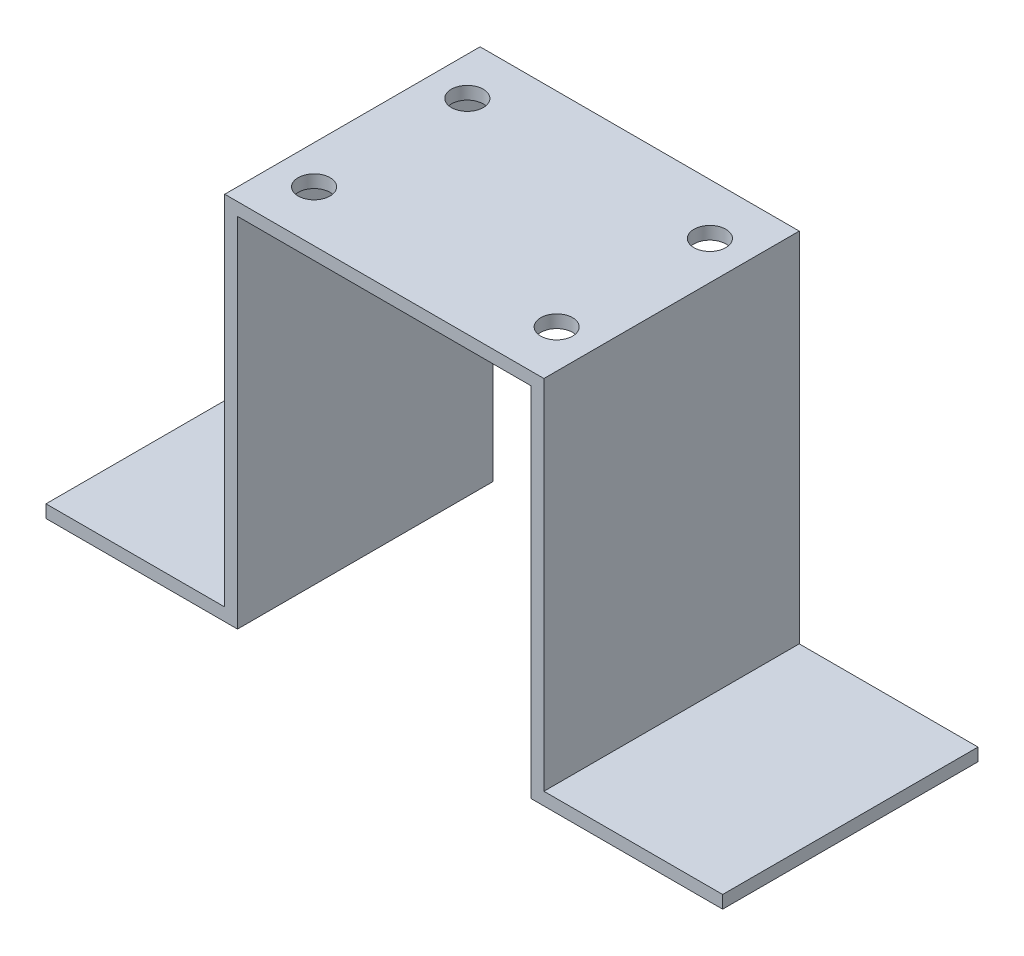
ISO-10303-21;
HEADER;
FILE_DESCRIPTION(('STEP AP214'),'2;1');
FILE_NAME('part.step','',(''),(''),'','','');
FILE_SCHEMA(('AUTOMOTIVE_DESIGN { 1 0 10303 214 1 1 1 1 }'));
ENDSEC;
DATA;
#1=APPLICATION_CONTEXT('core data for automotive mechanical design processes');
#2=APPLICATION_PROTOCOL_DEFINITION('international standard','automotive_design',2000,#1);
#3=PRODUCT_CONTEXT('',#1,'mechanical');
#4=PRODUCT('Part','Part','',(#3));
#5=PRODUCT_RELATED_PRODUCT_CATEGORY('part','',(#4));
#6=PRODUCT_DEFINITION_FORMATION('','',#4);
#7=PRODUCT_DEFINITION_CONTEXT('part definition',#1,'design');
#8=PRODUCT_DEFINITION('design','',#6,#7);
#9=PRODUCT_DEFINITION_SHAPE('','',#8);
#10=(LENGTH_UNIT() NAMED_UNIT(*) SI_UNIT(.MILLI.,.METRE.));
#11=(NAMED_UNIT(*) PLANE_ANGLE_UNIT() SI_UNIT($,.RADIAN.));
#12=(NAMED_UNIT(*) SI_UNIT($,.STERADIAN.) SOLID_ANGLE_UNIT());
#13=UNCERTAINTY_MEASURE_WITH_UNIT(LENGTH_MEASURE(1.E-05),#10,'distance_accuracy_value','');
#14=(GEOMETRIC_REPRESENTATION_CONTEXT(3) GLOBAL_UNCERTAINTY_ASSIGNED_CONTEXT((#13)) GLOBAL_UNIT_ASSIGNED_CONTEXT((#10,
#11,#12)) REPRESENTATION_CONTEXT('',''));
#15=CARTESIAN_POINT('',(0.,0.,0.));
#16=DIRECTION('',(0.,0.,1.));
#17=DIRECTION('',(1.,0.,0.));
#18=AXIS2_PLACEMENT_3D('',#15,#16,#17);
#19=CARTESIAN_POINT('',(0.,2.54,-50.8));
#20=DIRECTION('',(-1.,0.,0.));
#21=DIRECTION('',(0.,0.,1.));
#22=AXIS2_PLACEMENT_3D('',#19,#20,#21);
#23=PLANE('',#22);
#24=DIRECTION('',(0.,-1.,0.));
#25=VECTOR('',#24,1.);
#26=CARTESIAN_POINT('',(0.,2.54,0.));
#27=LINE('',#26,#25);
#28=CARTESIAN_POINT('',(0.,2.54,0.));
#29=VERTEX_POINT('',#28);
#30=CARTESIAN_POINT('',(0.,0.,0.));
#31=VERTEX_POINT('',#30);
#32=EDGE_CURVE('E154',#29,#31,#27,.T.);
#33=ORIENTED_EDGE('',*,*,#32,.F.);
#34=DIRECTION('',(0.,0.,1.));
#35=VECTOR('',#34,1.);
#36=CARTESIAN_POINT('',(0.,2.54,-50.8));
#37=LINE('',#36,#35);
#38=CARTESIAN_POINT('',(0.,2.54,-50.8));
#39=VERTEX_POINT('',#38);
#40=EDGE_CURVE('E11',#39,#29,#37,.T.);
#41=ORIENTED_EDGE('',*,*,#40,.F.);
#42=DIRECTION('',(0.,-1.,0.));
#43=VECTOR('',#42,1.);
#44=CARTESIAN_POINT('',(0.,2.54,-50.8));
#45=LINE('',#44,#43);
#46=CARTESIAN_POINT('',(0.,0.,-50.8));
#47=VERTEX_POINT('',#46);
#48=EDGE_CURVE('E187',#39,#47,#45,.T.);
#49=ORIENTED_EDGE('',*,*,#48,.T.);
#50=DIRECTION('',(0.,0.,1.));
#51=VECTOR('',#50,1.);
#52=CARTESIAN_POINT('',(0.,0.,-50.8));
#53=LINE('',#52,#51);
#54=EDGE_CURVE('E36',#47,#31,#53,.T.);
#55=ORIENTED_EDGE('',*,*,#54,.T.);
#56=EDGE_LOOP('',(#33,#41,#49,#55));
#57=FACE_BOUND('',#56,.T.);
#58=ADVANCED_FACE('F33',(#57),#23,.T.);
#59=CARTESIAN_POINT('',(35.56,2.54,-50.8));
#60=DIRECTION('',(0.,1.,0.));
#61=DIRECTION('',(0.,0.,1.));
#62=AXIS2_PLACEMENT_3D('',#59,#60,#61);
#63=PLANE('',#62);
#64=DIRECTION('',(-1.,0.,0.));
#65=VECTOR('',#64,1.);
#66=CARTESIAN_POINT('',(35.56,2.54,0.));
#67=LINE('',#66,#65);
#68=CARTESIAN_POINT('',(35.56,2.54,0.));
#69=VERTEX_POINT('',#68);
#70=EDGE_CURVE('E185',#69,#29,#67,.T.);
#71=ORIENTED_EDGE('',*,*,#70,.F.);
#72=DIRECTION('',(0.,0.,1.));
#73=VECTOR('',#72,1.);
#74=CARTESIAN_POINT('',(35.56,2.54,-50.8));
#75=LINE('',#74,#73);
#76=CARTESIAN_POINT('',(35.56,2.54,-50.8));
#77=VERTEX_POINT('',#76);
#78=EDGE_CURVE('E42',#77,#69,#75,.T.);
#79=ORIENTED_EDGE('',*,*,#78,.F.);
#80=DIRECTION('',(-1.,0.,0.));
#81=VECTOR('',#80,1.);
#82=CARTESIAN_POINT('',(35.56,2.54,-50.8));
#83=LINE('',#82,#81);
#84=EDGE_CURVE('E144',#77,#39,#83,.T.);
#85=ORIENTED_EDGE('',*,*,#84,.T.);
#86=ORIENTED_EDGE('',*,*,#40,.T.);
#87=EDGE_LOOP('',(#71,#79,#85,#86));
#88=FACE_BOUND('',#87,.T.);
#89=ADVANCED_FACE('F207',(#88),#63,.T.);
#90=CARTESIAN_POINT('',(35.56,73.66,-50.8));
#91=DIRECTION('',(-1.,0.,0.));
#92=DIRECTION('',(0.,-1.,0.));
#93=AXIS2_PLACEMENT_3D('',#90,#91,#92);
#94=PLANE('',#93);
#95=DIRECTION('',(0.,-1.,0.));
#96=VECTOR('',#95,1.);
#97=CARTESIAN_POINT('',(35.56,73.66,0.));
#98=LINE('',#97,#96);
#99=CARTESIAN_POINT('',(35.56,73.66,0.));
#100=VERTEX_POINT('',#99);
#101=EDGE_CURVE('E131',#100,#69,#98,.T.);
#102=ORIENTED_EDGE('',*,*,#101,.F.);
#103=DIRECTION('',(0.,0.,1.));
#104=VECTOR('',#103,1.);
#105=CARTESIAN_POINT('',(35.56,73.66,-50.8));
#106=LINE('',#105,#104);
#107=CARTESIAN_POINT('',(35.56,73.66,-50.8));
#108=VERTEX_POINT('',#107);
#109=EDGE_CURVE('E126',#108,#100,#106,.T.);
#110=ORIENTED_EDGE('',*,*,#109,.F.);
#111=DIRECTION('',(0.,-1.,0.));
#112=VECTOR('',#111,1.);
#113=CARTESIAN_POINT('',(35.56,73.66,-50.8));
#114=LINE('',#113,#112);
#115=EDGE_CURVE('E129',#108,#77,#114,.T.);
#116=ORIENTED_EDGE('',*,*,#115,.T.);
#117=ORIENTED_EDGE('',*,*,#78,.T.);
#118=EDGE_LOOP('',(#102,#110,#116,#117));
#119=FACE_BOUND('',#118,.T.);
#120=ADVANCED_FACE('F128',(#119),#94,.T.);
#121=CARTESIAN_POINT('',(99.06,73.66,-50.8));
#122=DIRECTION('',(0.,1.,0.));
#123=DIRECTION('',(-1.,0.,0.));
#124=AXIS2_PLACEMENT_3D('',#121,#122,#123);
#125=PLANE('',#124);
#126=CARTESIAN_POINT('',(43.18,73.66,-40.64));
#127=DIRECTION('',(0.,1.,0.));
#128=DIRECTION('',(-1.,0.,0.));
#129=AXIS2_PLACEMENT_3D('',#126,#127,#128);
#130=CIRCLE('',#129,3.17500000000001);
#131=CARTESIAN_POINT('',(40.005,73.66,-40.64));
#132=VERTEX_POINT('',#131);
#133=EDGE_CURVE('E279',#132,#132,#130,.T.);
#134=ORIENTED_EDGE('',*,*,#133,.F.);
#135=EDGE_LOOP('',(#134));
#136=FACE_BOUND('',#135,.T.);
#137=CARTESIAN_POINT('',(91.44,73.66,-40.64));
#138=DIRECTION('',(0.,1.,0.));
#139=DIRECTION('',(-1.,0.,0.));
#140=AXIS2_PLACEMENT_3D('',#137,#138,#139);
#141=CIRCLE('',#140,3.175);
#142=CARTESIAN_POINT('',(88.265,73.66,-40.64));
#143=VERTEX_POINT('',#142);
#144=EDGE_CURVE('E283',#143,#143,#141,.T.);
#145=ORIENTED_EDGE('',*,*,#144,.F.);
#146=EDGE_LOOP('',(#145));
#147=FACE_BOUND('',#146,.T.);
#148=CARTESIAN_POINT('',(91.44,73.66,-10.16));
#149=DIRECTION('',(0.,1.,0.));
#150=DIRECTION('',(-1.,0.,0.));
#151=AXIS2_PLACEMENT_3D('',#148,#149,#150);
#152=CIRCLE('',#151,3.175);
#153=CARTESIAN_POINT('',(88.265,73.66,-10.16));
#154=VERTEX_POINT('',#153);
#155=EDGE_CURVE('E290',#154,#154,#152,.T.);
#156=ORIENTED_EDGE('',*,*,#155,.F.);
#157=EDGE_LOOP('',(#156));
#158=FACE_BOUND('',#157,.T.);
#159=CARTESIAN_POINT('',(43.18,73.66,-10.16));
#160=DIRECTION('',(0.,1.,0.));
#161=DIRECTION('',(-1.,0.,0.));
#162=AXIS2_PLACEMENT_3D('',#159,#160,#161);
#163=CIRCLE('',#162,3.17500000000001);
#164=CARTESIAN_POINT('',(40.005,73.66,-10.16));
#165=VERTEX_POINT('',#164);
#166=EDGE_CURVE('E158',#165,#165,#163,.T.);
#167=ORIENTED_EDGE('',*,*,#166,.F.);
#168=EDGE_LOOP('',(#167));
#169=FACE_BOUND('',#168,.T.);
#170=DIRECTION('',(-1.,0.,0.));
#171=VECTOR('',#170,1.);
#172=CARTESIAN_POINT('',(99.06,73.66,0.));
#173=LINE('',#172,#171);
#174=CARTESIAN_POINT('',(99.06,73.66,0.));
#175=VERTEX_POINT('',#174);
#176=EDGE_CURVE('E182',#175,#100,#173,.T.);
#177=ORIENTED_EDGE('',*,*,#176,.F.);
#178=DIRECTION('',(0.,0.,1.));
#179=VECTOR('',#178,1.);
#180=CARTESIAN_POINT('',(99.06,73.66,-50.8));
#181=LINE('',#180,#179);
#182=CARTESIAN_POINT('',(99.06,73.66,-50.8));
#183=VERTEX_POINT('',#182);
#184=EDGE_CURVE('E136',#183,#175,#181,.T.);
#185=ORIENTED_EDGE('',*,*,#184,.F.);
#186=DIRECTION('',(-1.,0.,0.));
#187=VECTOR('',#186,1.);
#188=CARTESIAN_POINT('',(99.06,73.66,-50.8));
#189=LINE('',#188,#187);
#190=EDGE_CURVE('E142',#183,#108,#189,.T.);
#191=ORIENTED_EDGE('',*,*,#190,.T.);
#192=ORIENTED_EDGE('',*,*,#109,.T.);
#193=EDGE_LOOP('',(#177,#185,#191,#192));
#194=FACE_BOUND('',#193,.T.);
#195=ADVANCED_FACE('F146',(#136,#147,#158,#169,#194),#125,.T.);
#196=CARTESIAN_POINT('',(99.06,2.54000000000001,-50.8));
#197=DIRECTION('',(1.,0.,0.));
#198=DIRECTION('',(0.,0.,-1.));
#199=AXIS2_PLACEMENT_3D('',#196,#197,#198);
#200=PLANE('',#199);
#201=DIRECTION('',(0.,1.,0.));
#202=VECTOR('',#201,1.);
#203=CARTESIAN_POINT('',(99.06,2.54000000000001,0.));
#204=LINE('',#203,#202);
#205=CARTESIAN_POINT('',(99.06,2.54000000000001,0.));
#206=VERTEX_POINT('',#205);
#207=EDGE_CURVE('E179',#206,#175,#204,.T.);
#208=ORIENTED_EDGE('',*,*,#207,.F.);
#209=DIRECTION('',(0.,0.,1.));
#210=VECTOR('',#209,1.);
#211=CARTESIAN_POINT('',(99.06,2.54000000000001,-50.8));
#212=LINE('',#211,#210);
#213=CARTESIAN_POINT('',(99.06,2.54000000000001,-50.8));
#214=VERTEX_POINT('',#213);
#215=EDGE_CURVE('E191',#214,#206,#212,.T.);
#216=ORIENTED_EDGE('',*,*,#215,.F.);
#217=DIRECTION('',(0.,1.,0.));
#218=VECTOR('',#217,1.);
#219=CARTESIAN_POINT('',(99.06,2.54000000000001,-50.8));
#220=LINE('',#219,#218);
#221=EDGE_CURVE('E147',#214,#183,#220,.T.);
#222=ORIENTED_EDGE('',*,*,#221,.T.);
#223=ORIENTED_EDGE('',*,*,#184,.T.);
#224=EDGE_LOOP('',(#208,#216,#222,#223));
#225=FACE_BOUND('',#224,.T.);
#226=ADVANCED_FACE('F220',(#225),#200,.T.);
#227=CARTESIAN_POINT('',(134.62,2.54000000000002,-50.8));
#228=DIRECTION('',(0.,1.,0.));
#229=DIRECTION('',(-1.,0.,0.));
#230=AXIS2_PLACEMENT_3D('',#227,#228,#229);
#231=PLANE('',#230);
#232=DIRECTION('',(-1.,0.,0.));
#233=VECTOR('',#232,1.);
#234=CARTESIAN_POINT('',(134.62,2.54000000000002,0.));
#235=LINE('',#234,#233);
#236=CARTESIAN_POINT('',(134.62,2.54000000000002,0.));
#237=VERTEX_POINT('',#236);
#238=EDGE_CURVE('E176',#237,#206,#235,.T.);
#239=ORIENTED_EDGE('',*,*,#238,.F.);
#240=DIRECTION('',(0.,0.,1.));
#241=VECTOR('',#240,1.);
#242=CARTESIAN_POINT('',(134.62,2.54000000000002,-50.8));
#243=LINE('',#242,#241);
#244=CARTESIAN_POINT('',(134.62,2.54000000000002,-50.8));
#245=VERTEX_POINT('',#244);
#246=EDGE_CURVE('E193',#245,#237,#243,.T.);
#247=ORIENTED_EDGE('',*,*,#246,.F.);
#248=DIRECTION('',(-1.,0.,0.));
#249=VECTOR('',#248,1.);
#250=CARTESIAN_POINT('',(134.62,2.54000000000002,-50.8));
#251=LINE('',#250,#249);
#252=EDGE_CURVE('E149',#245,#214,#251,.T.);
#253=ORIENTED_EDGE('',*,*,#252,.T.);
#254=ORIENTED_EDGE('',*,*,#215,.T.);
#255=EDGE_LOOP('',(#239,#247,#253,#254));
#256=FACE_BOUND('',#255,.T.);
#257=ADVANCED_FACE('F224',(#256),#231,.T.);
#258=CARTESIAN_POINT('',(134.62,0.,-50.8));
#259=DIRECTION('',(1.,0.,0.));
#260=DIRECTION('',(0.,0.,-1.));
#261=AXIS2_PLACEMENT_3D('',#258,#259,#260);
#262=PLANE('',#261);
#263=DIRECTION('',(0.,1.,0.));
#264=VECTOR('',#263,1.);
#265=CARTESIAN_POINT('',(134.62,0.,0.));
#266=LINE('',#265,#264);
#267=CARTESIAN_POINT('',(134.62,0.,0.));
#268=VERTEX_POINT('',#267);
#269=EDGE_CURVE('E173',#268,#237,#266,.T.);
#270=ORIENTED_EDGE('',*,*,#269,.F.);
#271=DIRECTION('',(0.,0.,1.));
#272=VECTOR('',#271,1.);
#273=CARTESIAN_POINT('',(134.62,0.,-50.8));
#274=LINE('',#273,#272);
#275=CARTESIAN_POINT('',(134.62,0.,-50.8));
#276=VERTEX_POINT('',#275);
#277=EDGE_CURVE('E195',#276,#268,#274,.T.);
#278=ORIENTED_EDGE('',*,*,#277,.F.);
#279=DIRECTION('',(0.,1.,0.));
#280=VECTOR('',#279,1.);
#281=CARTESIAN_POINT('',(134.62,0.,-50.8));
#282=LINE('',#281,#280);
#283=EDGE_CURVE('E315',#276,#245,#282,.T.);
#284=ORIENTED_EDGE('',*,*,#283,.T.);
#285=ORIENTED_EDGE('',*,*,#246,.T.);
#286=EDGE_LOOP('',(#270,#278,#284,#285));
#287=FACE_BOUND('',#286,.T.);
#288=ADVANCED_FACE('F228',(#287),#262,.T.);
#289=CARTESIAN_POINT('',(96.52,0.,-50.8));
#290=DIRECTION('',(0.,-1.,0.));
#291=DIRECTION('',(0.,0.,-1.));
#292=AXIS2_PLACEMENT_3D('',#289,#290,#291);
#293=PLANE('',#292);
#294=DIRECTION('',(1.,0.,0.));
#295=VECTOR('',#294,1.);
#296=CARTESIAN_POINT('',(96.52,0.,0.));
#297=LINE('',#296,#295);
#298=CARTESIAN_POINT('',(96.52,0.,0.));
#299=VERTEX_POINT('',#298);
#300=EDGE_CURVE('E170',#299,#268,#297,.T.);
#301=ORIENTED_EDGE('',*,*,#300,.F.);
#302=DIRECTION('',(0.,0.,1.));
#303=VECTOR('',#302,1.);
#304=CARTESIAN_POINT('',(96.52,0.,-50.8));
#305=LINE('',#304,#303);
#306=CARTESIAN_POINT('',(96.52,0.,-50.8));
#307=VERTEX_POINT('',#306);
#308=EDGE_CURVE('E197',#307,#299,#305,.T.);
#309=ORIENTED_EDGE('',*,*,#308,.F.);
#310=DIRECTION('',(1.,0.,0.));
#311=VECTOR('',#310,1.);
#312=CARTESIAN_POINT('',(96.52,0.,-50.8));
#313=LINE('',#312,#311);
#314=EDGE_CURVE('E312',#307,#276,#313,.T.);
#315=ORIENTED_EDGE('',*,*,#314,.T.);
#316=ORIENTED_EDGE('',*,*,#277,.T.);
#317=EDGE_LOOP('',(#301,#309,#315,#316));
#318=FACE_BOUND('',#317,.T.);
#319=ADVANCED_FACE('F232',(#318),#293,.T.);
#320=CARTESIAN_POINT('',(96.52,71.12,-50.8));
#321=DIRECTION('',(-1.,0.,0.));
#322=DIRECTION('',(0.,0.,1.));
#323=AXIS2_PLACEMENT_3D('',#320,#321,#322);
#324=PLANE('',#323);
#325=DIRECTION('',(0.,-1.,0.));
#326=VECTOR('',#325,1.);
#327=CARTESIAN_POINT('',(96.52,71.12,0.));
#328=LINE('',#327,#326);
#329=CARTESIAN_POINT('',(96.52,71.12,0.));
#330=VERTEX_POINT('',#329);
#331=EDGE_CURVE('E167',#330,#299,#328,.T.);
#332=ORIENTED_EDGE('',*,*,#331,.F.);
#333=DIRECTION('',(0.,0.,1.));
#334=VECTOR('',#333,1.);
#335=CARTESIAN_POINT('',(96.52,71.12,-50.8));
#336=LINE('',#335,#334);
#337=CARTESIAN_POINT('',(96.52,71.12,-50.8));
#338=VERTEX_POINT('',#337);
#339=EDGE_CURVE('E199',#338,#330,#336,.T.);
#340=ORIENTED_EDGE('',*,*,#339,.F.);
#341=DIRECTION('',(0.,-1.,0.));
#342=VECTOR('',#341,1.);
#343=CARTESIAN_POINT('',(96.52,71.12,-50.8));
#344=LINE('',#343,#342);
#345=EDGE_CURVE('E309',#338,#307,#344,.T.);
#346=ORIENTED_EDGE('',*,*,#345,.T.);
#347=ORIENTED_EDGE('',*,*,#308,.T.);
#348=EDGE_LOOP('',(#332,#340,#346,#347));
#349=FACE_BOUND('',#348,.T.);
#350=ADVANCED_FACE('F236',(#349),#324,.T.);
#351=CARTESIAN_POINT('',(38.1,71.12,-50.8));
#352=DIRECTION('',(0.,-1.,0.));
#353=DIRECTION('',(0.,0.,-1.));
#354=AXIS2_PLACEMENT_3D('',#351,#352,#353);
#355=PLANE('',#354);
#356=CARTESIAN_POINT('',(43.18,71.12,-40.64));
#357=DIRECTION('',(0.,-1.,0.));
#358=DIRECTION('',(0.,0.,-1.));
#359=AXIS2_PLACEMENT_3D('',#356,#357,#358);
#360=CIRCLE('',#359,3.17500000000001);
#361=CARTESIAN_POINT('',(43.18,71.12,-43.815));
#362=VERTEX_POINT('',#361);
#363=EDGE_CURVE('E276',#362,#362,#360,.F.);
#364=ORIENTED_EDGE('',*,*,#363,.T.);
#365=EDGE_LOOP('',(#364));
#366=FACE_BOUND('',#365,.T.);
#367=CARTESIAN_POINT('',(91.44,71.12,-40.64));
#368=DIRECTION('',(0.,-1.,0.));
#369=DIRECTION('',(0.,0.,-1.));
#370=AXIS2_PLACEMENT_3D('',#367,#368,#369);
#371=CIRCLE('',#370,3.175);
#372=CARTESIAN_POINT('',(91.44,71.12,-43.815));
#373=VERTEX_POINT('',#372);
#374=EDGE_CURVE('E280',#373,#373,#371,.F.);
#375=ORIENTED_EDGE('',*,*,#374,.T.);
#376=EDGE_LOOP('',(#375));
#377=FACE_BOUND('',#376,.T.);
#378=CARTESIAN_POINT('',(91.44,71.12,-10.16));
#379=DIRECTION('',(0.,-1.,0.));
#380=DIRECTION('',(0.,0.,-1.));
#381=AXIS2_PLACEMENT_3D('',#378,#379,#380);
#382=CIRCLE('',#381,3.175);
#383=CARTESIAN_POINT('',(91.44,71.12,-13.335));
#384=VERTEX_POINT('',#383);
#385=EDGE_CURVE('E288',#384,#384,#382,.F.);
#386=ORIENTED_EDGE('',*,*,#385,.T.);
#387=EDGE_LOOP('',(#386));
#388=FACE_BOUND('',#387,.T.);
#389=CARTESIAN_POINT('',(43.18,71.12,-10.16));
#390=DIRECTION('',(0.,-1.,0.));
#391=DIRECTION('',(0.,0.,-1.));
#392=AXIS2_PLACEMENT_3D('',#389,#390,#391);
#393=CIRCLE('',#392,3.17500000000001);
#394=CARTESIAN_POINT('',(43.18,71.12,-13.335));
#395=VERTEX_POINT('',#394);
#396=EDGE_CURVE('E293',#395,#395,#393,.F.);
#397=ORIENTED_EDGE('',*,*,#396,.T.);
#398=EDGE_LOOP('',(#397));
#399=FACE_BOUND('',#398,.T.);
#400=DIRECTION('',(1.,0.,0.));
#401=VECTOR('',#400,1.);
#402=CARTESIAN_POINT('',(38.1,71.12,0.));
#403=LINE('',#402,#401);
#404=CARTESIAN_POINT('',(38.1,71.12,0.));
#405=VERTEX_POINT('',#404);
#406=EDGE_CURVE('E164',#405,#330,#403,.T.);
#407=ORIENTED_EDGE('',*,*,#406,.F.);
#408=DIRECTION('',(0.,0.,1.));
#409=VECTOR('',#408,1.);
#410=CARTESIAN_POINT('',(38.1,71.12,-50.8));
#411=LINE('',#410,#409);
#412=CARTESIAN_POINT('',(38.1,71.12,-50.8));
#413=VERTEX_POINT('',#412);
#414=EDGE_CURVE('E201',#413,#405,#411,.T.);
#415=ORIENTED_EDGE('',*,*,#414,.F.);
#416=DIRECTION('',(1.,0.,0.));
#417=VECTOR('',#416,1.);
#418=CARTESIAN_POINT('',(38.1,71.12,-50.8));
#419=LINE('',#418,#417);
#420=EDGE_CURVE('E306',#413,#338,#419,.T.);
#421=ORIENTED_EDGE('',*,*,#420,.T.);
#422=ORIENTED_EDGE('',*,*,#339,.T.);
#423=EDGE_LOOP('',(#407,#415,#421,#422));
#424=FACE_BOUND('',#423,.T.);
#425=ADVANCED_FACE('F240',(#366,#377,#388,#399,#424),#355,.T.);
#426=CARTESIAN_POINT('',(38.1,0.,-50.8));
#427=DIRECTION('',(1.,0.,0.));
#428=DIRECTION('',(0.,0.,-1.));
#429=AXIS2_PLACEMENT_3D('',#426,#427,#428);
#430=PLANE('',#429);
#431=DIRECTION('',(0.,1.,0.));
#432=VECTOR('',#431,1.);
#433=CARTESIAN_POINT('',(38.1,0.,0.));
#434=LINE('',#433,#432);
#435=CARTESIAN_POINT('',(38.1,0.,0.));
#436=VERTEX_POINT('',#435);
#437=EDGE_CURVE('E161',#436,#405,#434,.T.);
#438=ORIENTED_EDGE('',*,*,#437,.F.);
#439=DIRECTION('',(0.,0.,1.));
#440=VECTOR('',#439,1.);
#441=CARTESIAN_POINT('',(38.1,0.,-50.8));
#442=LINE('',#441,#440);
#443=CARTESIAN_POINT('',(38.1,0.,-50.8));
#444=VERTEX_POINT('',#443);
#445=EDGE_CURVE('E202',#444,#436,#442,.T.);
#446=ORIENTED_EDGE('',*,*,#445,.F.);
#447=DIRECTION('',(0.,1.,0.));
#448=VECTOR('',#447,1.);
#449=CARTESIAN_POINT('',(38.1,0.,-50.8));
#450=LINE('',#449,#448);
#451=EDGE_CURVE('E303',#444,#413,#450,.T.);
#452=ORIENTED_EDGE('',*,*,#451,.T.);
#453=ORIENTED_EDGE('',*,*,#414,.T.);
#454=EDGE_LOOP('',(#438,#446,#452,#453));
#455=FACE_BOUND('',#454,.T.);
#456=ADVANCED_FACE('F244',(#455),#430,.T.);
#457=CARTESIAN_POINT('',(0.,0.,-50.8));
#458=DIRECTION('',(0.,-1.,0.));
#459=DIRECTION('',(0.,0.,-1.));
#460=AXIS2_PLACEMENT_3D('',#457,#458,#459);
#461=PLANE('',#460);
#462=DIRECTION('',(1.,0.,0.));
#463=VECTOR('',#462,1.);
#464=CARTESIAN_POINT('',(0.,0.,0.));
#465=LINE('',#464,#463);
#466=EDGE_CURVE('E157',#31,#436,#465,.T.);
#467=ORIENTED_EDGE('',*,*,#466,.F.);
#468=ORIENTED_EDGE('',*,*,#54,.F.);
#469=DIRECTION('',(1.,0.,0.));
#470=VECTOR('',#469,1.);
#471=CARTESIAN_POINT('',(0.,0.,-50.8));
#472=LINE('',#471,#470);
#473=EDGE_CURVE('E301',#47,#444,#472,.T.);
#474=ORIENTED_EDGE('',*,*,#473,.T.);
#475=ORIENTED_EDGE('',*,*,#445,.T.);
#476=EDGE_LOOP('',(#467,#468,#474,#475));
#477=FACE_BOUND('',#476,.T.);
#478=ADVANCED_FACE('F204',(#477),#461,.T.);
#479=CARTESIAN_POINT('',(0.,0.,-50.8));
#480=DIRECTION('',(0.,0.,1.));
#481=DIRECTION('',(1.,0.,0.));
#482=AXIS2_PLACEMENT_3D('',#479,#480,#481);
#483=PLANE('',#482);
#484=ORIENTED_EDGE('',*,*,#48,.F.);
#485=ORIENTED_EDGE('',*,*,#84,.F.);
#486=ORIENTED_EDGE('',*,*,#115,.F.);
#487=ORIENTED_EDGE('',*,*,#190,.F.);
#488=ORIENTED_EDGE('',*,*,#221,.F.);
#489=ORIENTED_EDGE('',*,*,#252,.F.);
#490=ORIENTED_EDGE('',*,*,#283,.F.);
#491=ORIENTED_EDGE('',*,*,#314,.F.);
#492=ORIENTED_EDGE('',*,*,#345,.F.);
#493=ORIENTED_EDGE('',*,*,#420,.F.);
#494=ORIENTED_EDGE('',*,*,#451,.F.);
#495=ORIENTED_EDGE('',*,*,#473,.F.);
#496=EDGE_LOOP('',(#484,#485,#486,#487,#488,#489,#490,#491,#492,#493,#494,#495));
#497=FACE_BOUND('',#496,.T.);
#498=ADVANCED_FACE('F140',(#497),#483,.F.);
#499=CARTESIAN_POINT('',(0.,0.,0.));
#500=DIRECTION('',(0.,0.,1.));
#501=DIRECTION('',(1.,0.,0.));
#502=AXIS2_PLACEMENT_3D('',#499,#500,#501);
#503=PLANE('',#502);
#504=ORIENTED_EDGE('',*,*,#32,.T.);
#505=ORIENTED_EDGE('',*,*,#466,.T.);
#506=ORIENTED_EDGE('',*,*,#437,.T.);
#507=ORIENTED_EDGE('',*,*,#406,.T.);
#508=ORIENTED_EDGE('',*,*,#331,.T.);
#509=ORIENTED_EDGE('',*,*,#300,.T.);
#510=ORIENTED_EDGE('',*,*,#269,.T.);
#511=ORIENTED_EDGE('',*,*,#238,.T.);
#512=ORIENTED_EDGE('',*,*,#207,.T.);
#513=ORIENTED_EDGE('',*,*,#176,.T.);
#514=ORIENTED_EDGE('',*,*,#101,.T.);
#515=ORIENTED_EDGE('',*,*,#70,.T.);
#516=EDGE_LOOP('',(#504,#505,#506,#507,#508,#509,#510,#511,#512,#513,#514,#515));
#517=FACE_BOUND('',#516,.T.);
#518=ADVANCED_FACE('F206',(#517),#503,.T.);
#519=CARTESIAN_POINT('',(43.18,-0.00100000000001488,-10.16));
#520=DIRECTION('',(0.,1.,0.));
#521=DIRECTION('',(-1.,0.,0.));
#522=AXIS2_PLACEMENT_3D('',#519,#520,#521);
#523=CYLINDRICAL_SURFACE('',#522,3.17500000000001);
#524=ORIENTED_EDGE('',*,*,#396,.F.);
#525=EDGE_LOOP('',(#524));
#526=FACE_BOUND('',#525,.T.);
#527=ORIENTED_EDGE('',*,*,#166,.T.);
#528=EDGE_LOOP('',(#527));
#529=FACE_BOUND('',#528,.T.);
#530=ADVANCED_FACE('F255',(#526,#529),#523,.F.);
#531=CARTESIAN_POINT('',(91.44,-0.00100000000001488,-10.16));
#532=DIRECTION('',(0.,1.,0.));
#533=DIRECTION('',(-1.,0.,0.));
#534=AXIS2_PLACEMENT_3D('',#531,#532,#533);
#535=CYLINDRICAL_SURFACE('',#534,3.175);
#536=ORIENTED_EDGE('',*,*,#385,.F.);
#537=EDGE_LOOP('',(#536));
#538=FACE_BOUND('',#537,.T.);
#539=ORIENTED_EDGE('',*,*,#155,.T.);
#540=EDGE_LOOP('',(#539));
#541=FACE_BOUND('',#540,.T.);
#542=ADVANCED_FACE('F259',(#538,#541),#535,.F.);
#543=CARTESIAN_POINT('',(91.44,-0.00100000000001488,-40.64));
#544=DIRECTION('',(0.,1.,0.));
#545=DIRECTION('',(-1.,0.,0.));
#546=AXIS2_PLACEMENT_3D('',#543,#544,#545);
#547=CYLINDRICAL_SURFACE('',#546,3.175);
#548=ORIENTED_EDGE('',*,*,#374,.F.);
#549=EDGE_LOOP('',(#548));
#550=FACE_BOUND('',#549,.T.);
#551=ORIENTED_EDGE('',*,*,#144,.T.);
#552=EDGE_LOOP('',(#551));
#553=FACE_BOUND('',#552,.T.);
#554=ADVANCED_FACE('F263',(#550,#553),#547,.F.);
#555=CARTESIAN_POINT('',(43.18,-0.00100000000001488,-40.64));
#556=DIRECTION('',(0.,1.,0.));
#557=DIRECTION('',(-1.,0.,0.));
#558=AXIS2_PLACEMENT_3D('',#555,#556,#557);
#559=CYLINDRICAL_SURFACE('',#558,3.17500000000001);
#560=ORIENTED_EDGE('',*,*,#363,.F.);
#561=EDGE_LOOP('',(#560));
#562=FACE_BOUND('',#561,.T.);
#563=ORIENTED_EDGE('',*,*,#133,.T.);
#564=EDGE_LOOP('',(#563));
#565=FACE_BOUND('',#564,.T.);
#566=ADVANCED_FACE('F267',(#562,#565),#559,.F.);
#567=CLOSED_SHELL('',(#58,#89,#120,#195,#226,#257,#288,#319,#350,#425,#456,#478,#498,#518,#530,
#542,#554,#566));
#568=MANIFOLD_SOLID_BREP('B2',#567);
#569=ADVANCED_BREP_SHAPE_REPRESENTATION('',(#18,#568),#14);
#570=SHAPE_DEFINITION_REPRESENTATION(#9,#569);
ENDSEC;
END-ISO-10303-21;
